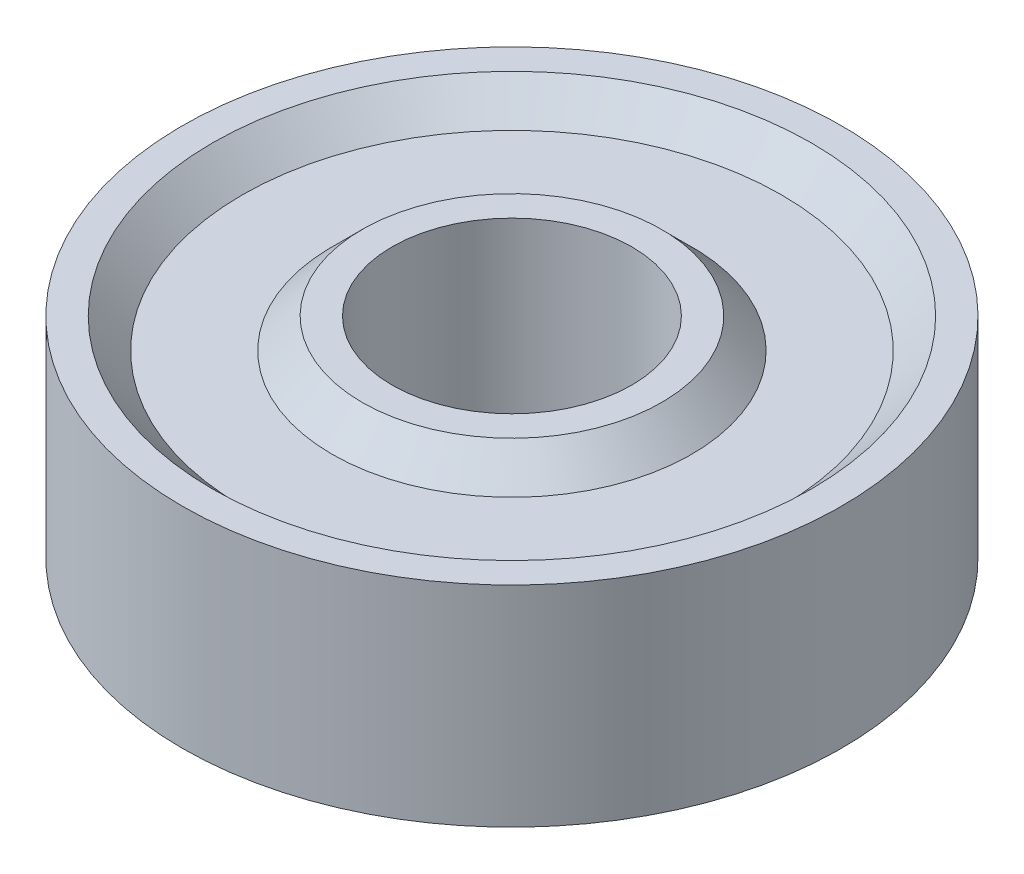
ISO-10303-21;
HEADER;
FILE_DESCRIPTION(('STEP AP214'),'2;1');
FILE_NAME('part.step','',(''),(''),'','','');
FILE_SCHEMA(('AUTOMOTIVE_DESIGN { 1 0 10303 214 1 1 1 1 }'));
ENDSEC;
DATA;
#1=APPLICATION_CONTEXT('core data for automotive mechanical design processes');
#2=APPLICATION_PROTOCOL_DEFINITION('international standard','automotive_design',2000,#1);
#3=PRODUCT_CONTEXT('',#1,'mechanical');
#4=PRODUCT('Part','Part','',(#3));
#5=PRODUCT_RELATED_PRODUCT_CATEGORY('part','',(#4));
#6=PRODUCT_DEFINITION_FORMATION('','',#4);
#7=PRODUCT_DEFINITION_CONTEXT('part definition',#1,'design');
#8=PRODUCT_DEFINITION('design','',#6,#7);
#9=PRODUCT_DEFINITION_SHAPE('','',#8);
#10=(LENGTH_UNIT() NAMED_UNIT(*) SI_UNIT(.MILLI.,.METRE.));
#11=(NAMED_UNIT(*) PLANE_ANGLE_UNIT() SI_UNIT($,.RADIAN.));
#12=(NAMED_UNIT(*) SI_UNIT($,.STERADIAN.) SOLID_ANGLE_UNIT());
#13=UNCERTAINTY_MEASURE_WITH_UNIT(LENGTH_MEASURE(1.E-05),#10,'distance_accuracy_value','');
#14=(GEOMETRIC_REPRESENTATION_CONTEXT(3) GLOBAL_UNCERTAINTY_ASSIGNED_CONTEXT((#13)) GLOBAL_UNIT_ASSIGNED_CONTEXT((#10,
#11,#12)) REPRESENTATION_CONTEXT('',''));
#15=CARTESIAN_POINT('',(0.,0.,0.));
#16=DIRECTION('',(0.,0.,1.));
#17=DIRECTION('',(1.,0.,0.));
#18=AXIS2_PLACEMENT_3D('',#15,#16,#17);
#19=CARTESIAN_POINT('',(5.,3.5,0.));
#20=DIRECTION('',(0.,-1.,0.));
#21=DIRECTION('',(0.,0.,-1.));
#22=AXIS2_PLACEMENT_3D('',#19,#20,#21);
#23=PLANE('',#22);
#24=CARTESIAN_POINT('',(0.,3.5,0.));
#25=DIRECTION('',(0.,1.,0.));
#26=DIRECTION('',(0.,0.,1.));
#27=AXIS2_PLACEMENT_3D('',#24,#25,#26);
#28=CIRCLE('',#27,4.);
#29=CARTESIAN_POINT('',(0.,3.5,4.));
#30=VERTEX_POINT('',#29);
#31=EDGE_CURVE('E10',#30,#30,#28,.T.);
#32=ORIENTED_EDGE('',*,*,#31,.F.);
#33=EDGE_LOOP('',(#32));
#34=FACE_BOUND('',#33,.T.);
#35=CARTESIAN_POINT('',(0.,3.5,0.));
#36=DIRECTION('',(0.,1.,0.));
#37=DIRECTION('',(0.,0.,1.));
#38=AXIS2_PLACEMENT_3D('',#35,#36,#37);
#39=CIRCLE('',#38,5.);
#40=CARTESIAN_POINT('',(0.,3.5,5.));
#41=VERTEX_POINT('',#40);
#42=EDGE_CURVE('E72',#41,#41,#39,.T.);
#43=ORIENTED_EDGE('',*,*,#42,.T.);
#44=EDGE_LOOP('',(#43));
#45=FACE_BOUND('',#44,.T.);
#46=ADVANCED_FACE('F32',(#34,#45),#23,.F.);
#47=CARTESIAN_POINT('',(0.,0.,0.));
#48=DIRECTION('',(0.,1.,0.));
#49=DIRECTION('',(0.,0.,1.));
#50=AXIS2_PLACEMENT_3D('',#47,#48,#49);
#51=CYLINDRICAL_SURFACE('',#50,4.);
#52=CARTESIAN_POINT('',(0.,-3.5,0.));
#53=DIRECTION('',(0.,1.,0.));
#54=DIRECTION('',(0.,0.,1.));
#55=AXIS2_PLACEMENT_3D('',#52,#53,#54);
#56=CIRCLE('',#55,4.);
#57=CARTESIAN_POINT('',(0.,-3.5,4.));
#58=VERTEX_POINT('',#57);
#59=EDGE_CURVE('E38',#58,#58,#56,.T.);
#60=ORIENTED_EDGE('',*,*,#59,.F.);
#61=EDGE_LOOP('',(#60));
#62=FACE_BOUND('',#61,.T.);
#63=ORIENTED_EDGE('',*,*,#31,.T.);
#64=EDGE_LOOP('',(#63));
#65=FACE_BOUND('',#64,.T.);
#66=ADVANCED_FACE('F133',(#62,#65),#51,.F.);
#67=CARTESIAN_POINT('',(5.,-3.5,0.));
#68=DIRECTION('',(0.,1.,0.));
#69=DIRECTION('',(0.,0.,1.));
#70=AXIS2_PLACEMENT_3D('',#67,#68,#69);
#71=PLANE('',#70);
#72=CARTESIAN_POINT('',(0.,-3.5,0.));
#73=DIRECTION('',(0.,1.,0.));
#74=DIRECTION('',(0.,0.,1.));
#75=AXIS2_PLACEMENT_3D('',#72,#73,#74);
#76=CIRCLE('',#75,5.);
#77=CARTESIAN_POINT('',(0.,-3.5,5.));
#78=VERTEX_POINT('',#77);
#79=EDGE_CURVE('E42',#78,#78,#76,.T.);
#80=ORIENTED_EDGE('',*,*,#79,.F.);
#81=EDGE_LOOP('',(#80));
#82=FACE_BOUND('',#81,.T.);
#83=ORIENTED_EDGE('',*,*,#59,.T.);
#84=EDGE_LOOP('',(#83));
#85=FACE_BOUND('',#84,.T.);
#86=ADVANCED_FACE('F128',(#82,#85),#71,.F.);
#87=CARTESIAN_POINT('',(0.,-3.5,0.));
#88=DIRECTION('',(0.,1.,0.));
#89=DIRECTION('',(0.,0.,1.));
#90=AXIS2_PLACEMENT_3D('',#87,#88,#89);
#91=CONICAL_SURFACE('',#90,5.,0.785398163397448);
#92=CARTESIAN_POINT('',(0.,-2.5,0.));
#93=DIRECTION('',(0.,1.,0.));
#94=DIRECTION('',(0.,0.,1.));
#95=AXIS2_PLACEMENT_3D('',#92,#93,#94);
#96=CIRCLE('',#95,6.);
#97=CARTESIAN_POINT('',(0.,-2.5,6.));
#98=VERTEX_POINT('',#97);
#99=EDGE_CURVE('E46',#98,#98,#96,.T.);
#100=ORIENTED_EDGE('',*,*,#99,.F.);
#101=EDGE_LOOP('',(#100));
#102=FACE_BOUND('',#101,.T.);
#103=ORIENTED_EDGE('',*,*,#79,.T.);
#104=EDGE_LOOP('',(#103));
#105=FACE_BOUND('',#104,.T.);
#106=ADVANCED_FACE('F122',(#102,#105),#91,.T.);
#107=CARTESIAN_POINT('',(9.,-2.5,0.));
#108=DIRECTION('',(0.,1.,0.));
#109=DIRECTION('',(0.,0.,1.));
#110=AXIS2_PLACEMENT_3D('',#107,#108,#109);
#111=PLANE('',#110);
#112=CARTESIAN_POINT('',(0.,-2.5,0.));
#113=DIRECTION('',(0.,1.,0.));
#114=DIRECTION('',(0.,0.,1.));
#115=AXIS2_PLACEMENT_3D('',#112,#113,#114);
#116=CIRCLE('',#115,9.);
#117=CARTESIAN_POINT('',(0.,-2.5,9.));
#118=VERTEX_POINT('',#117);
#119=EDGE_CURVE('E51',#118,#118,#116,.T.);
#120=ORIENTED_EDGE('',*,*,#119,.F.);
#121=EDGE_LOOP('',(#120));
#122=FACE_BOUND('',#121,.T.);
#123=ORIENTED_EDGE('',*,*,#99,.T.);
#124=EDGE_LOOP('',(#123));
#125=FACE_BOUND('',#124,.T.);
#126=ADVANCED_FACE('F116',(#122,#125),#111,.F.);
#127=CARTESIAN_POINT('',(0.,-2.5,0.));
#128=DIRECTION('',(0.,-1.,0.));
#129=DIRECTION('',(0.,0.,-1.));
#130=AXIS2_PLACEMENT_3D('',#127,#128,#129);
#131=CONICAL_SURFACE('',#130,9.,0.785398163397449);
#132=CARTESIAN_POINT('',(0.,-3.5,0.));
#133=DIRECTION('',(0.,1.,0.));
#134=DIRECTION('',(0.,0.,1.));
#135=AXIS2_PLACEMENT_3D('',#132,#133,#134);
#136=CIRCLE('',#135,10.);
#137=CARTESIAN_POINT('',(0.,-3.5,10.));
#138=VERTEX_POINT('',#137);
#139=EDGE_CURVE('E54',#138,#138,#136,.T.);
#140=ORIENTED_EDGE('',*,*,#139,.F.);
#141=EDGE_LOOP('',(#140));
#142=FACE_BOUND('',#141,.T.);
#143=ORIENTED_EDGE('',*,*,#119,.T.);
#144=EDGE_LOOP('',(#143));
#145=FACE_BOUND('',#144,.T.);
#146=ADVANCED_FACE('F110',(#142,#145),#131,.F.);
#147=CARTESIAN_POINT('',(11.,-3.5,0.));
#148=DIRECTION('',(0.,1.,0.));
#149=DIRECTION('',(0.,0.,1.));
#150=AXIS2_PLACEMENT_3D('',#147,#148,#149);
#151=PLANE('',#150);
#152=CARTESIAN_POINT('',(0.,-3.5,0.));
#153=DIRECTION('',(0.,1.,0.));
#154=DIRECTION('',(0.,0.,1.));
#155=AXIS2_PLACEMENT_3D('',#152,#153,#154);
#156=CIRCLE('',#155,11.);
#157=CARTESIAN_POINT('',(0.,-3.5,11.));
#158=VERTEX_POINT('',#157);
#159=EDGE_CURVE('E57',#158,#158,#156,.T.);
#160=ORIENTED_EDGE('',*,*,#159,.F.);
#161=EDGE_LOOP('',(#160));
#162=FACE_BOUND('',#161,.T.);
#163=ORIENTED_EDGE('',*,*,#139,.T.);
#164=EDGE_LOOP('',(#163));
#165=FACE_BOUND('',#164,.T.);
#166=ADVANCED_FACE('F104',(#162,#165),#151,.F.);
#167=CARTESIAN_POINT('',(0.,0.,0.));
#168=DIRECTION('',(0.,1.,0.));
#169=DIRECTION('',(0.,0.,1.));
#170=AXIS2_PLACEMENT_3D('',#167,#168,#169);
#171=CYLINDRICAL_SURFACE('',#170,11.);
#172=CARTESIAN_POINT('',(0.,3.5,0.));
#173=DIRECTION('',(0.,1.,0.));
#174=DIRECTION('',(0.,0.,1.));
#175=AXIS2_PLACEMENT_3D('',#172,#173,#174);
#176=CIRCLE('',#175,11.);
#177=CARTESIAN_POINT('',(0.,3.5,11.));
#178=VERTEX_POINT('',#177);
#179=EDGE_CURVE('E60',#178,#178,#176,.T.);
#180=ORIENTED_EDGE('',*,*,#179,.F.);
#181=EDGE_LOOP('',(#180));
#182=FACE_BOUND('',#181,.T.);
#183=ORIENTED_EDGE('',*,*,#159,.T.);
#184=EDGE_LOOP('',(#183));
#185=FACE_BOUND('',#184,.T.);
#186=ADVANCED_FACE('F98',(#182,#185),#171,.T.);
#187=CARTESIAN_POINT('',(11.,3.5,0.));
#188=DIRECTION('',(0.,-1.,0.));
#189=DIRECTION('',(0.,0.,-1.));
#190=AXIS2_PLACEMENT_3D('',#187,#188,#189);
#191=PLANE('',#190);
#192=CARTESIAN_POINT('',(0.,3.5,0.));
#193=DIRECTION('',(0.,1.,0.));
#194=DIRECTION('',(0.,0.,1.));
#195=AXIS2_PLACEMENT_3D('',#192,#193,#194);
#196=CIRCLE('',#195,10.);
#197=CARTESIAN_POINT('',(0.,3.5,10.));
#198=VERTEX_POINT('',#197);
#199=EDGE_CURVE('E63',#198,#198,#196,.T.);
#200=ORIENTED_EDGE('',*,*,#199,.F.);
#201=EDGE_LOOP('',(#200));
#202=FACE_BOUND('',#201,.T.);
#203=ORIENTED_EDGE('',*,*,#179,.T.);
#204=EDGE_LOOP('',(#203));
#205=FACE_BOUND('',#204,.T.);
#206=ADVANCED_FACE('F92',(#202,#205),#191,.F.);
#207=CARTESIAN_POINT('',(0.,3.5,0.));
#208=DIRECTION('',(0.,1.,0.));
#209=DIRECTION('',(0.,0.,1.));
#210=AXIS2_PLACEMENT_3D('',#207,#208,#209);
#211=CONICAL_SURFACE('',#210,10.,0.785398163397449);
#212=CARTESIAN_POINT('',(0.,2.5,0.));
#213=DIRECTION('',(0.,1.,0.));
#214=DIRECTION('',(0.,0.,1.));
#215=AXIS2_PLACEMENT_3D('',#212,#213,#214);
#216=CIRCLE('',#215,9.);
#217=CARTESIAN_POINT('',(0.,2.5,9.));
#218=VERTEX_POINT('',#217);
#219=EDGE_CURVE('E66',#218,#218,#216,.T.);
#220=ORIENTED_EDGE('',*,*,#219,.F.);
#221=EDGE_LOOP('',(#220));
#222=FACE_BOUND('',#221,.T.);
#223=ORIENTED_EDGE('',*,*,#199,.T.);
#224=EDGE_LOOP('',(#223));
#225=FACE_BOUND('',#224,.T.);
#226=ADVANCED_FACE('F86',(#222,#225),#211,.F.);
#227=CARTESIAN_POINT('',(9.,2.5,0.));
#228=DIRECTION('',(0.,-1.,0.));
#229=DIRECTION('',(0.,0.,-1.));
#230=AXIS2_PLACEMENT_3D('',#227,#228,#229);
#231=PLANE('',#230);
#232=CARTESIAN_POINT('',(0.,2.5,0.));
#233=DIRECTION('',(0.,1.,0.));
#234=DIRECTION('',(0.,0.,1.));
#235=AXIS2_PLACEMENT_3D('',#232,#233,#234);
#236=CIRCLE('',#235,6.);
#237=CARTESIAN_POINT('',(0.,2.5,6.));
#238=VERTEX_POINT('',#237);
#239=EDGE_CURVE('E69',#238,#238,#236,.T.);
#240=ORIENTED_EDGE('',*,*,#239,.F.);
#241=EDGE_LOOP('',(#240));
#242=FACE_BOUND('',#241,.T.);
#243=ORIENTED_EDGE('',*,*,#219,.T.);
#244=EDGE_LOOP('',(#243));
#245=FACE_BOUND('',#244,.T.);
#246=ADVANCED_FACE('F80',(#242,#245),#231,.F.);
#247=CARTESIAN_POINT('',(0.,2.5,0.));
#248=DIRECTION('',(0.,-1.,0.));
#249=DIRECTION('',(0.,0.,-1.));
#250=AXIS2_PLACEMENT_3D('',#247,#248,#249);
#251=CONICAL_SURFACE('',#250,6.,0.785398163397448);
#252=ORIENTED_EDGE('',*,*,#42,.F.);
#253=EDGE_LOOP('',(#252));
#254=FACE_BOUND('',#253,.T.);
#255=ORIENTED_EDGE('',*,*,#239,.T.);
#256=EDGE_LOOP('',(#255));
#257=FACE_BOUND('',#256,.T.);
#258=ADVANCED_FACE('F77',(#254,#257),#251,.T.);
#259=CLOSED_SHELL('',(#46,#66,#86,#106,#126,#146,#166,#186,#206,#226,#246,#258));
#260=MANIFOLD_SOLID_BREP('B2',#259);
#261=ADVANCED_BREP_SHAPE_REPRESENTATION('',(#18,#260),#14);
#262=SHAPE_DEFINITION_REPRESENTATION(#9,#261);
ENDSEC;
END-ISO-10303-21;
